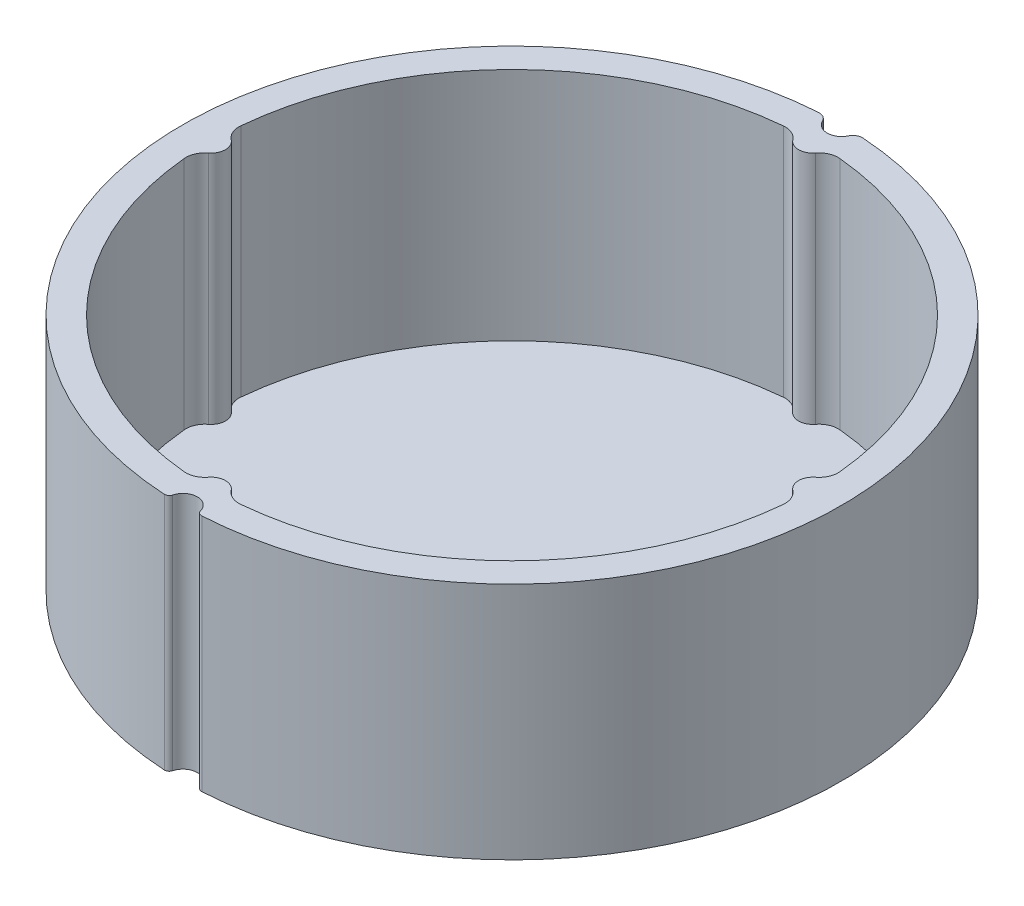
ISO-10303-21;
HEADER;
FILE_DESCRIPTION(('STEP AP214'),'2;1');
FILE_NAME('part.step','',(''),(''),'','','');
FILE_SCHEMA(('AUTOMOTIVE_DESIGN { 1 0 10303 214 1 1 1 1 }'));
ENDSEC;
DATA;
#1=APPLICATION_CONTEXT('core data for automotive mechanical design processes');
#2=APPLICATION_PROTOCOL_DEFINITION('international standard','automotive_design',2000,#1);
#3=PRODUCT_CONTEXT('',#1,'mechanical');
#4=PRODUCT('Part','Part','',(#3));
#5=PRODUCT_RELATED_PRODUCT_CATEGORY('part','',(#4));
#6=PRODUCT_DEFINITION_FORMATION('','',#4);
#7=PRODUCT_DEFINITION_CONTEXT('part definition',#1,'design');
#8=PRODUCT_DEFINITION('design','',#6,#7);
#9=PRODUCT_DEFINITION_SHAPE('','',#8);
#10=(LENGTH_UNIT() NAMED_UNIT(*) SI_UNIT(.MILLI.,.METRE.));
#11=(NAMED_UNIT(*) PLANE_ANGLE_UNIT() SI_UNIT($,.RADIAN.));
#12=(NAMED_UNIT(*) SI_UNIT($,.STERADIAN.) SOLID_ANGLE_UNIT());
#13=UNCERTAINTY_MEASURE_WITH_UNIT(LENGTH_MEASURE(1.E-05),#10,'distance_accuracy_value','');
#14=(GEOMETRIC_REPRESENTATION_CONTEXT(3) GLOBAL_UNCERTAINTY_ASSIGNED_CONTEXT((#13)) GLOBAL_UNIT_ASSIGNED_CONTEXT((#10,
#11,#12)) REPRESENTATION_CONTEXT('',''));
#15=CARTESIAN_POINT('',(0.,0.,0.));
#16=DIRECTION('',(0.,0.,1.));
#17=DIRECTION('',(1.,0.,0.));
#18=AXIS2_PLACEMENT_3D('',#15,#16,#17);
#19=CARTESIAN_POINT('',(0.,25.,0.));
#20=DIRECTION('',(0.,1.,0.));
#21=DIRECTION('',(0.,0.,1.));
#22=AXIS2_PLACEMENT_3D('',#19,#20,#21);
#23=PLANE('',#22);
#24=CARTESIAN_POINT('',(-1.93575856721061,25.,33.9428491683965));
#25=DIRECTION('',(0.,1.,0.));
#26=DIRECTION('',(0.,0.,1.));
#27=AXIS2_PLACEMENT_3D('',#24,#25,#26);
#28=CIRCLE('',#27,0.500000000000003);
#29=CARTESIAN_POINT('',(-1.45181892540796,25.,34.0685568574689));
#30=VERTEX_POINT('',#29);
#31=CARTESIAN_POINT('',(-1.96422560496371,25.,34.4420381383884));
#32=VERTEX_POINT('',#31);
#33=EDGE_CURVE('E338',#30,#32,#28,.F.);
#34=ORIENTED_EDGE('',*,*,#33,.F.);
#35=CARTESIAN_POINT('',(0.,25.,34.4456799246862));
#36=DIRECTION('',(0.,1.,0.));
#37=DIRECTION('',(0.,0.,1.));
#38=AXIS2_PLACEMENT_3D('',#35,#36,#37);
#39=CIRCLE('',#38,1.50000000000002);
#40=CARTESIAN_POINT('',(1.45181892540796,25.,34.0685568574689));
#41=VERTEX_POINT('',#40);
#42=EDGE_CURVE('E342',#41,#30,#39,.T.);
#43=ORIENTED_EDGE('',*,*,#42,.F.);
#44=CARTESIAN_POINT('',(1.93575856721061,25.,33.9428491683965));
#45=DIRECTION('',(0.,1.,0.));
#46=DIRECTION('',(0.,0.,1.));
#47=AXIS2_PLACEMENT_3D('',#44,#45,#46);
#48=CIRCLE('',#47,0.500000000000003);
#49=CARTESIAN_POINT('',(1.9642256049637,25.,34.4420381383884));
#50=VERTEX_POINT('',#49);
#51=EDGE_CURVE('E347',#41,#50,#48,.T.);
#52=ORIENTED_EDGE('',*,*,#51,.T.);
#53=CARTESIAN_POINT('',(0.,25.,-0.0020007910519898));
#54=DIRECTION('',(0.,1.,0.));
#55=DIRECTION('',(0.,0.,1.));
#56=AXIS2_PLACEMENT_3D('',#53,#54,#55);
#57=CIRCLE('',#56,34.5);
#58=CARTESIAN_POINT('',(2.32413582105506,25.,-34.4236276074198));
#59=VERTEX_POINT('',#58);
#60=EDGE_CURVE('E350',#50,#59,#57,.T.);
#61=ORIENTED_EDGE('',*,*,#60,.T.);
#62=CARTESIAN_POINT('',(2.2567695653723,25.,-33.4258992939019));
#63=DIRECTION('',(0.,1.,0.));
#64=DIRECTION('',(0.,0.,1.));
#65=AXIS2_PLACEMENT_3D('',#62,#63,#64);
#66=CIRCLE('',#65,1.);
#67=CARTESIAN_POINT('',(1.35406173922335,25.,-33.8561533823304));
#68=VERTEX_POINT('',#67);
#69=EDGE_CURVE('E353',#68,#59,#66,.F.);
#70=ORIENTED_EDGE('',*,*,#69,.F.);
#71=CARTESIAN_POINT('',(0.,25.,-34.5015345149731));
#72=DIRECTION('',(0.,1.,0.));
#73=DIRECTION('',(0.,0.,1.));
#74=AXIS2_PLACEMENT_3D('',#71,#72,#73);
#75=CIRCLE('',#74,1.49999999999991);
#76=CARTESIAN_POINT('',(-1.35406173922335,25.,-33.8561533823304));
#77=VERTEX_POINT('',#76);
#78=EDGE_CURVE('E357',#77,#68,#75,.T.);
#79=ORIENTED_EDGE('',*,*,#78,.F.);
#80=CARTESIAN_POINT('',(-2.2567695653723,25.,-33.4258992939019));
#81=DIRECTION('',(0.,1.,0.));
#82=DIRECTION('',(0.,0.,1.));
#83=AXIS2_PLACEMENT_3D('',#80,#81,#82);
#84=CIRCLE('',#83,1.);
#85=CARTESIAN_POINT('',(-2.32413582105505,25.,-34.4236276074198));
#86=VERTEX_POINT('',#85);
#87=EDGE_CURVE('E361',#77,#86,#84,.T.);
#88=ORIENTED_EDGE('',*,*,#87,.T.);
#89=CARTESIAN_POINT('',(0.,25.,-0.0020007910519898));
#90=DIRECTION('',(0.,1.,0.));
#91=DIRECTION('',(0.,0.,1.));
#92=AXIS2_PLACEMENT_3D('',#89,#90,#91);
#93=CIRCLE('',#92,34.5);
#94=EDGE_CURVE('E364',#86,#32,#93,.T.);
#95=ORIENTED_EDGE('',*,*,#94,.T.);
#96=EDGE_LOOP('',(#34,#43,#52,#61,#70,#79,#88,#95));
#97=FACE_BOUND('',#96,.T.);
#98=CARTESIAN_POINT('',(0.,25.,0.));
#99=DIRECTION('',(0.,1.,0.));
#100=DIRECTION('',(0.,0.,1.));
#101=AXIS2_PLACEMENT_3D('',#98,#99,#100);
#102=CIRCLE('',#101,31.5);
#103=CARTESIAN_POINT('',(-31.3601694915254,25.,2.96475453668566));
#104=VERTEX_POINT('',#103);
#105=CARTESIAN_POINT('',(-2.96475453668564,25.,31.3601694915254));
#106=VERTEX_POINT('',#105);
#107=EDGE_CURVE('E233',#104,#106,#102,.T.);
#108=ORIENTED_EDGE('',*,*,#107,.F.);
#109=CARTESIAN_POINT('',(-29.3690476190476,25.,2.77651615340405));
#110=DIRECTION('',(0.,1.,0.));
#111=DIRECTION('',(0.,0.,1.));
#112=AXIS2_PLACEMENT_3D('',#109,#110,#111);
#113=CIRCLE('',#112,2.00000000000001);
#114=CARTESIAN_POINT('',(-30.5867346938775,25.,1.18993549431604));
#115=VERTEX_POINT('',#114);
#116=EDGE_CURVE('E229',#115,#104,#113,.T.);
#117=ORIENTED_EDGE('',*,*,#116,.F.);
#118=CARTESIAN_POINT('',(-31.5,25.,0.));
#119=DIRECTION('',(0.,-1.,0.));
#120=DIRECTION('',(0.,0.,1.));
#121=AXIS2_PLACEMENT_3D('',#118,#119,#120);
#122=CIRCLE('',#121,1.50000000000004);
#123=CARTESIAN_POINT('',(-30.5867346938775,25.,-1.18993549431604));
#124=VERTEX_POINT('',#123);
#125=EDGE_CURVE('E211',#124,#115,#122,.T.);
#126=ORIENTED_EDGE('',*,*,#125,.F.);
#127=CARTESIAN_POINT('',(-29.3690476190476,25.,-2.77651615340405));
#128=DIRECTION('',(0.,1.,0.));
#129=DIRECTION('',(0.,0.,-1.));
#130=AXIS2_PLACEMENT_3D('',#127,#128,#129);
#131=CIRCLE('',#130,2.00000000000001);
#132=CARTESIAN_POINT('',(-31.3601694915254,25.,-2.96475453668568));
#133=VERTEX_POINT('',#132);
#134=EDGE_CURVE('E277',#133,#124,#131,.T.);
#135=ORIENTED_EDGE('',*,*,#134,.F.);
#136=CARTESIAN_POINT('',(0.,25.,0.));
#137=DIRECTION('',(0.,1.,0.));
#138=DIRECTION('',(0.,0.,1.));
#139=AXIS2_PLACEMENT_3D('',#136,#137,#138);
#140=CIRCLE('',#139,31.5);
#141=CARTESIAN_POINT('',(-2.96475453668563,25.,-31.3601694915254));
#142=VERTEX_POINT('',#141);
#143=EDGE_CURVE('E274',#142,#133,#140,.T.);
#144=ORIENTED_EDGE('',*,*,#143,.F.);
#145=CARTESIAN_POINT('',(-2.77651615340401,25.,-29.3690476190476));
#146=DIRECTION('',(0.,1.,0.));
#147=DIRECTION('',(0.,0.,1.));
#148=AXIS2_PLACEMENT_3D('',#145,#146,#147);
#149=CIRCLE('',#148,2.);
#150=CARTESIAN_POINT('',(-1.189935494316,25.,-30.5867346938775));
#151=VERTEX_POINT('',#150);
#152=EDGE_CURVE('E271',#151,#142,#149,.T.);
#153=ORIENTED_EDGE('',*,*,#152,.F.);
#154=CARTESIAN_POINT('',(0.,25.,-31.5));
#155=DIRECTION('',(0.,-1.,0.));
#156=DIRECTION('',(0.,0.,1.));
#157=AXIS2_PLACEMENT_3D('',#154,#155,#156);
#158=CIRCLE('',#157,1.5);
#159=CARTESIAN_POINT('',(1.189935494316,25.,-30.5867346938775));
#160=VERTEX_POINT('',#159);
#161=EDGE_CURVE('E268',#160,#151,#158,.T.);
#162=ORIENTED_EDGE('',*,*,#161,.F.);
#163=CARTESIAN_POINT('',(2.77651615340401,25.,-29.3690476190476));
#164=DIRECTION('',(0.,1.,0.));
#165=DIRECTION('',(0.,0.,-1.));
#166=AXIS2_PLACEMENT_3D('',#163,#164,#165);
#167=CIRCLE('',#166,2.);
#168=CARTESIAN_POINT('',(2.96475453668564,25.,-31.3601694915254));
#169=VERTEX_POINT('',#168);
#170=EDGE_CURVE('E265',#169,#160,#167,.T.);
#171=ORIENTED_EDGE('',*,*,#170,.F.);
#172=CARTESIAN_POINT('',(0.,25.,0.));
#173=DIRECTION('',(0.,1.,0.));
#174=DIRECTION('',(0.,0.,1.));
#175=AXIS2_PLACEMENT_3D('',#172,#173,#174);
#176=CIRCLE('',#175,31.5);
#177=CARTESIAN_POINT('',(31.3601694915254,25.,-2.96475453668564));
#178=VERTEX_POINT('',#177);
#179=EDGE_CURVE('E262',#178,#169,#176,.T.);
#180=ORIENTED_EDGE('',*,*,#179,.F.);
#181=CARTESIAN_POINT('',(29.3690476190476,25.,-2.77651615340401));
#182=DIRECTION('',(0.,1.,0.));
#183=DIRECTION('',(0.,0.,1.));
#184=AXIS2_PLACEMENT_3D('',#181,#182,#183);
#185=CIRCLE('',#184,2.);
#186=CARTESIAN_POINT('',(30.5867346938775,25.,-1.189935494316));
#187=VERTEX_POINT('',#186);
#188=EDGE_CURVE('E259',#187,#178,#185,.T.);
#189=ORIENTED_EDGE('',*,*,#188,.F.);
#190=CARTESIAN_POINT('',(31.5,25.,0.));
#191=DIRECTION('',(0.,-1.,0.));
#192=DIRECTION('',(0.,0.,1.));
#193=AXIS2_PLACEMENT_3D('',#190,#191,#192);
#194=CIRCLE('',#193,1.5);
#195=CARTESIAN_POINT('',(30.5867346938775,25.,1.189935494316));
#196=VERTEX_POINT('',#195);
#197=EDGE_CURVE('E256',#196,#187,#194,.T.);
#198=ORIENTED_EDGE('',*,*,#197,.F.);
#199=CARTESIAN_POINT('',(29.3690476190476,25.,2.77651615340401));
#200=DIRECTION('',(0.,1.,0.));
#201=DIRECTION('',(0.,0.,-1.));
#202=AXIS2_PLACEMENT_3D('',#199,#200,#201);
#203=CIRCLE('',#202,2.);
#204=CARTESIAN_POINT('',(31.3601694915254,25.,2.96475453668564));
#205=VERTEX_POINT('',#204);
#206=EDGE_CURVE('E253',#205,#196,#203,.T.);
#207=ORIENTED_EDGE('',*,*,#206,.F.);
#208=CARTESIAN_POINT('',(0.,25.,0.));
#209=DIRECTION('',(0.,1.,0.));
#210=DIRECTION('',(0.,0.,1.));
#211=AXIS2_PLACEMENT_3D('',#208,#209,#210);
#212=CIRCLE('',#211,31.5);
#213=CARTESIAN_POINT('',(2.96475453668564,25.,31.3601694915254));
#214=VERTEX_POINT('',#213);
#215=EDGE_CURVE('E250',#214,#205,#212,.T.);
#216=ORIENTED_EDGE('',*,*,#215,.F.);
#217=CARTESIAN_POINT('',(2.77651615340401,25.,29.3690476190476));
#218=DIRECTION('',(0.,1.,0.));
#219=DIRECTION('',(0.,0.,1.));
#220=AXIS2_PLACEMENT_3D('',#217,#218,#219);
#221=CIRCLE('',#220,2.);
#222=CARTESIAN_POINT('',(1.189935494316,25.,30.5867346938775));
#223=VERTEX_POINT('',#222);
#224=EDGE_CURVE('E247',#223,#214,#221,.T.);
#225=ORIENTED_EDGE('',*,*,#224,.F.);
#226=CARTESIAN_POINT('',(0.,25.,31.5));
#227=DIRECTION('',(0.,-1.,0.));
#228=DIRECTION('',(0.,0.,1.));
#229=AXIS2_PLACEMENT_3D('',#226,#227,#228);
#230=CIRCLE('',#229,1.5);
#231=CARTESIAN_POINT('',(-1.189935494316,25.,30.5867346938775));
#232=VERTEX_POINT('',#231);
#233=EDGE_CURVE('E244',#232,#223,#230,.T.);
#234=ORIENTED_EDGE('',*,*,#233,.F.);
#235=CARTESIAN_POINT('',(-2.77651615340401,25.,29.3690476190476));
#236=DIRECTION('',(0.,1.,0.));
#237=DIRECTION('',(0.,0.,-1.));
#238=AXIS2_PLACEMENT_3D('',#235,#236,#237);
#239=CIRCLE('',#238,2.);
#240=EDGE_CURVE('E241',#106,#232,#239,.T.);
#241=ORIENTED_EDGE('',*,*,#240,.F.);
#242=EDGE_LOOP('',(#108,#117,#126,#135,#144,#153,#162,#171,#180,#189,#198,#207,#216,#225,#234,#241));
#243=FACE_BOUND('',#242,.T.);
#244=ADVANCED_FACE('F41',(#97,#243),#23,.T.);
#245=CARTESIAN_POINT('',(0.,0.,0.));
#246=DIRECTION('',(0.,1.,0.));
#247=DIRECTION('',(0.,0.,1.));
#248=AXIS2_PLACEMENT_3D('',#245,#246,#247);
#249=PLANE('',#248);
#250=CARTESIAN_POINT('',(-1.93575856721061,0.,33.9428491683965));
#251=DIRECTION('',(0.,1.,0.));
#252=DIRECTION('',(0.,0.,1.));
#253=AXIS2_PLACEMENT_3D('',#250,#251,#252);
#254=CIRCLE('',#253,0.500000000000003);
#255=CARTESIAN_POINT('',(-1.45181892540796,0.,34.0685568574689));
#256=VERTEX_POINT('',#255);
#257=CARTESIAN_POINT('',(-1.96422560496371,0.,34.4420381383884));
#258=VERTEX_POINT('',#257);
#259=EDGE_CURVE('E337',#256,#258,#254,.F.);
#260=ORIENTED_EDGE('',*,*,#259,.T.);
#261=CARTESIAN_POINT('',(0.,0.,-0.0020007910519898));
#262=DIRECTION('',(0.,1.,0.));
#263=DIRECTION('',(0.,0.,1.));
#264=AXIS2_PLACEMENT_3D('',#261,#262,#263);
#265=CIRCLE('',#264,34.5);
#266=CARTESIAN_POINT('',(-2.32413582105505,0.,-34.4236276074198));
#267=VERTEX_POINT('',#266);
#268=EDGE_CURVE('E343',#267,#258,#265,.T.);
#269=ORIENTED_EDGE('',*,*,#268,.F.);
#270=CARTESIAN_POINT('',(-2.2567695653723,0.,-33.4258992939019));
#271=DIRECTION('',(0.,1.,0.));
#272=DIRECTION('',(0.,0.,1.));
#273=AXIS2_PLACEMENT_3D('',#270,#271,#272);
#274=CIRCLE('',#273,1.);
#275=CARTESIAN_POINT('',(-1.35406173922335,0.,-33.8561533823304));
#276=VERTEX_POINT('',#275);
#277=EDGE_CURVE('E390',#276,#267,#274,.T.);
#278=ORIENTED_EDGE('',*,*,#277,.F.);
#279=CARTESIAN_POINT('',(0.,0.,-34.5015345149731));
#280=DIRECTION('',(0.,1.,0.));
#281=DIRECTION('',(0.,0.,1.));
#282=AXIS2_PLACEMENT_3D('',#279,#280,#281);
#283=CIRCLE('',#282,1.49999999999991);
#284=CARTESIAN_POINT('',(1.35406173922335,0.,-33.8561533823304));
#285=VERTEX_POINT('',#284);
#286=EDGE_CURVE('E386',#276,#285,#283,.T.);
#287=ORIENTED_EDGE('',*,*,#286,.T.);
#288=CARTESIAN_POINT('',(2.2567695653723,0.,-33.4258992939019));
#289=DIRECTION('',(0.,1.,0.));
#290=DIRECTION('',(0.,0.,1.));
#291=AXIS2_PLACEMENT_3D('',#288,#289,#290);
#292=CIRCLE('',#291,1.);
#293=CARTESIAN_POINT('',(2.32413582105506,0.,-34.4236276074198));
#294=VERTEX_POINT('',#293);
#295=EDGE_CURVE('E382',#285,#294,#292,.F.);
#296=ORIENTED_EDGE('',*,*,#295,.T.);
#297=CARTESIAN_POINT('',(0.,0.,-0.0020007910519898));
#298=DIRECTION('',(0.,1.,0.));
#299=DIRECTION('',(0.,0.,1.));
#300=AXIS2_PLACEMENT_3D('',#297,#298,#299);
#301=CIRCLE('',#300,34.5);
#302=CARTESIAN_POINT('',(1.9642256049637,0.,34.4420381383884));
#303=VERTEX_POINT('',#302);
#304=EDGE_CURVE('E378',#303,#294,#301,.T.);
#305=ORIENTED_EDGE('',*,*,#304,.F.);
#306=CARTESIAN_POINT('',(1.93575856721061,0.,33.9428491683965));
#307=DIRECTION('',(0.,1.,0.));
#308=DIRECTION('',(0.,0.,1.));
#309=AXIS2_PLACEMENT_3D('',#306,#307,#308);
#310=CIRCLE('',#309,0.500000000000003);
#311=CARTESIAN_POINT('',(1.45181892540796,0.,34.0685568574689));
#312=VERTEX_POINT('',#311);
#313=EDGE_CURVE('E375',#312,#303,#310,.T.);
#314=ORIENTED_EDGE('',*,*,#313,.F.);
#315=CARTESIAN_POINT('',(0.,0.,34.4456799246862));
#316=DIRECTION('',(0.,1.,0.));
#317=DIRECTION('',(0.,0.,1.));
#318=AXIS2_PLACEMENT_3D('',#315,#316,#317);
#319=CIRCLE('',#318,1.50000000000002);
#320=EDGE_CURVE('E371',#312,#256,#319,.T.);
#321=ORIENTED_EDGE('',*,*,#320,.T.);
#322=EDGE_LOOP('',(#260,#269,#278,#287,#296,#305,#314,#321));
#323=FACE_BOUND('',#322,.T.);
#324=ADVANCED_FACE('F425',(#323),#249,.F.);
#325=CARTESIAN_POINT('',(-1.93575856721061,25.,33.9428491683965));
#326=DIRECTION('',(0.,-1.,0.));
#327=DIRECTION('',(0.,0.,-1.));
#328=AXIS2_PLACEMENT_3D('',#325,#326,#327);
#329=CYLINDRICAL_SURFACE('',#328,0.500000000000003);
#330=ORIENTED_EDGE('',*,*,#259,.F.);
#331=DIRECTION('',(0.,-1.,0.));
#332=VECTOR('',#331,1.);
#333=CARTESIAN_POINT('',(-1.45181892540796,25.,34.0685568574689));
#334=LINE('',#333,#332);
#335=EDGE_CURVE('E11',#30,#256,#334,.T.);
#336=ORIENTED_EDGE('',*,*,#335,.F.);
#337=ORIENTED_EDGE('',*,*,#33,.T.);
#338=DIRECTION('',(0.,-1.,0.));
#339=VECTOR('',#338,1.);
#340=CARTESIAN_POINT('',(-1.96422560496371,25.,34.4420381383884));
#341=LINE('',#340,#339);
#342=EDGE_CURVE('E367',#32,#258,#341,.T.);
#343=ORIENTED_EDGE('',*,*,#342,.T.);
#344=EDGE_LOOP('',(#330,#336,#337,#343));
#345=FACE_BOUND('',#344,.T.);
#346=ADVANCED_FACE('F43',(#345),#329,.T.);
#347=CARTESIAN_POINT('',(0.,25.,34.4456799246862));
#348=DIRECTION('',(0.,-1.,0.));
#349=DIRECTION('',(0.,0.,-1.));
#350=AXIS2_PLACEMENT_3D('',#347,#348,#349);
#351=CYLINDRICAL_SURFACE('',#350,1.50000000000002);
#352=ORIENTED_EDGE('',*,*,#320,.F.);
#353=DIRECTION('',(0.,-1.,0.));
#354=VECTOR('',#353,1.);
#355=CARTESIAN_POINT('',(1.45181892540796,25.,34.0685568574689));
#356=LINE('',#355,#354);
#357=EDGE_CURVE('E50',#41,#312,#356,.T.);
#358=ORIENTED_EDGE('',*,*,#357,.F.);
#359=ORIENTED_EDGE('',*,*,#42,.T.);
#360=ORIENTED_EDGE('',*,*,#335,.T.);
#361=EDGE_LOOP('',(#352,#358,#359,#360));
#362=FACE_BOUND('',#361,.T.);
#363=ADVANCED_FACE('F426',(#362),#351,.F.);
#364=CARTESIAN_POINT('',(1.93575856721061,25.,33.9428491683965));
#365=DIRECTION('',(0.,-1.,0.));
#366=DIRECTION('',(0.,0.,-1.));
#367=AXIS2_PLACEMENT_3D('',#364,#365,#366);
#368=CYLINDRICAL_SURFACE('',#367,0.500000000000003);
#369=ORIENTED_EDGE('',*,*,#313,.T.);
#370=DIRECTION('',(0.,-1.,0.));
#371=VECTOR('',#370,1.);
#372=CARTESIAN_POINT('',(1.9642256049637,25.,34.4420381383884));
#373=LINE('',#372,#371);
#374=EDGE_CURVE('E411',#50,#303,#373,.T.);
#375=ORIENTED_EDGE('',*,*,#374,.F.);
#376=ORIENTED_EDGE('',*,*,#51,.F.);
#377=ORIENTED_EDGE('',*,*,#357,.T.);
#378=EDGE_LOOP('',(#369,#375,#376,#377));
#379=FACE_BOUND('',#378,.T.);
#380=ADVANCED_FACE('F418',(#379),#368,.T.);
#381=CARTESIAN_POINT('',(0.,25.,-0.0020007910519898));
#382=DIRECTION('',(0.,-1.,0.));
#383=DIRECTION('',(0.,0.,-1.));
#384=AXIS2_PLACEMENT_3D('',#381,#382,#383);
#385=CYLINDRICAL_SURFACE('',#384,34.5);
#386=ORIENTED_EDGE('',*,*,#304,.T.);
#387=DIRECTION('',(0.,-1.,0.));
#388=VECTOR('',#387,1.);
#389=CARTESIAN_POINT('',(2.32413582105506,25.,-34.4236276074198));
#390=LINE('',#389,#388);
#391=EDGE_CURVE('E408',#59,#294,#390,.T.);
#392=ORIENTED_EDGE('',*,*,#391,.F.);
#393=ORIENTED_EDGE('',*,*,#60,.F.);
#394=ORIENTED_EDGE('',*,*,#374,.T.);
#395=EDGE_LOOP('',(#386,#392,#393,#394));
#396=FACE_BOUND('',#395,.T.);
#397=ADVANCED_FACE('F451',(#396),#385,.T.);
#398=CARTESIAN_POINT('',(2.2567695653723,25.,-33.4258992939019));
#399=DIRECTION('',(0.,-1.,0.));
#400=DIRECTION('',(0.,0.,-1.));
#401=AXIS2_PLACEMENT_3D('',#398,#399,#400);
#402=CYLINDRICAL_SURFACE('',#401,1.);
#403=ORIENTED_EDGE('',*,*,#295,.F.);
#404=DIRECTION('',(0.,-1.,0.));
#405=VECTOR('',#404,1.);
#406=CARTESIAN_POINT('',(1.35406173922335,25.,-33.8561533823304));
#407=LINE('',#406,#405);
#408=EDGE_CURVE('E405',#68,#285,#407,.T.);
#409=ORIENTED_EDGE('',*,*,#408,.F.);
#410=ORIENTED_EDGE('',*,*,#69,.T.);
#411=ORIENTED_EDGE('',*,*,#391,.T.);
#412=EDGE_LOOP('',(#403,#409,#410,#411));
#413=FACE_BOUND('',#412,.T.);
#414=ADVANCED_FACE('F446',(#413),#402,.T.);
#415=CARTESIAN_POINT('',(0.,25.,-34.5015345149731));
#416=DIRECTION('',(0.,-1.,0.));
#417=DIRECTION('',(0.,0.,-1.));
#418=AXIS2_PLACEMENT_3D('',#415,#416,#417);
#419=CYLINDRICAL_SURFACE('',#418,1.49999999999991);
#420=ORIENTED_EDGE('',*,*,#286,.F.);
#421=DIRECTION('',(0.,-1.,0.));
#422=VECTOR('',#421,1.);
#423=CARTESIAN_POINT('',(-1.35406173922335,25.,-33.8561533823304));
#424=LINE('',#423,#422);
#425=EDGE_CURVE('E402',#77,#276,#424,.T.);
#426=ORIENTED_EDGE('',*,*,#425,.F.);
#427=ORIENTED_EDGE('',*,*,#78,.T.);
#428=ORIENTED_EDGE('',*,*,#408,.T.);
#429=EDGE_LOOP('',(#420,#426,#427,#428));
#430=FACE_BOUND('',#429,.T.);
#431=ADVANCED_FACE('F443',(#430),#419,.F.);
#432=CARTESIAN_POINT('',(-2.2567695653723,25.,-33.4258992939019));
#433=DIRECTION('',(0.,-1.,0.));
#434=DIRECTION('',(0.,0.,-1.));
#435=AXIS2_PLACEMENT_3D('',#432,#433,#434);
#436=CYLINDRICAL_SURFACE('',#435,1.);
#437=ORIENTED_EDGE('',*,*,#277,.T.);
#438=DIRECTION('',(0.,-1.,0.));
#439=VECTOR('',#438,1.);
#440=CARTESIAN_POINT('',(-2.32413582105505,25.,-34.4236276074198));
#441=LINE('',#440,#439);
#442=EDGE_CURVE('E398',#86,#267,#441,.T.);
#443=ORIENTED_EDGE('',*,*,#442,.F.);
#444=ORIENTED_EDGE('',*,*,#87,.F.);
#445=ORIENTED_EDGE('',*,*,#425,.T.);
#446=EDGE_LOOP('',(#437,#443,#444,#445));
#447=FACE_BOUND('',#446,.T.);
#448=ADVANCED_FACE('F440',(#447),#436,.T.);
#449=CARTESIAN_POINT('',(0.,25.,-0.0020007910519898));
#450=DIRECTION('',(0.,-1.,0.));
#451=DIRECTION('',(0.,0.,-1.));
#452=AXIS2_PLACEMENT_3D('',#449,#450,#451);
#453=CYLINDRICAL_SURFACE('',#452,34.5);
#454=ORIENTED_EDGE('',*,*,#268,.T.);
#455=ORIENTED_EDGE('',*,*,#342,.F.);
#456=ORIENTED_EDGE('',*,*,#94,.F.);
#457=ORIENTED_EDGE('',*,*,#442,.T.);
#458=EDGE_LOOP('',(#454,#455,#456,#457));
#459=FACE_BOUND('',#458,.T.);
#460=ADVANCED_FACE('F435',(#459),#453,.T.);
#461=CARTESIAN_POINT('',(-29.3690476190476,25.,2.77651615340405));
#462=DIRECTION('',(0.,-1.,0.));
#463=DIRECTION('',(0.,0.,-1.));
#464=AXIS2_PLACEMENT_3D('',#461,#462,#463);
#465=CYLINDRICAL_SURFACE('',#464,2.00000000000001);
#466=CARTESIAN_POINT('',(-29.3690476190476,0.4,2.77651615340405));
#467=DIRECTION('',(0.,1.,0.));
#468=DIRECTION('',(0.,0.,1.));
#469=AXIS2_PLACEMENT_3D('',#466,#467,#468);
#470=CIRCLE('',#469,2.00000000000001);
#471=CARTESIAN_POINT('',(-30.5867346938775,0.4,1.18993549431604));
#472=VERTEX_POINT('',#471);
#473=CARTESIAN_POINT('',(-31.3601694915254,0.400000000000001,2.96475453668566));
#474=VERTEX_POINT('',#473);
#475=EDGE_CURVE('E218',#472,#474,#470,.T.);
#476=ORIENTED_EDGE('',*,*,#475,.F.);
#477=DIRECTION('',(0.,-1.,0.));
#478=VECTOR('',#477,1.);
#479=CARTESIAN_POINT('',(-30.5867346938775,25.,1.18993549431604));
#480=LINE('',#479,#478);
#481=EDGE_CURVE('E204',#115,#472,#480,.T.);
#482=ORIENTED_EDGE('',*,*,#481,.F.);
#483=ORIENTED_EDGE('',*,*,#116,.T.);
#484=DIRECTION('',(0.,-1.,0.));
#485=VECTOR('',#484,1.);
#486=CARTESIAN_POINT('',(-31.3601694915254,25.,2.96475453668566));
#487=LINE('',#486,#485);
#488=EDGE_CURVE('E220',#104,#474,#487,.T.);
#489=ORIENTED_EDGE('',*,*,#488,.T.);
#490=EDGE_LOOP('',(#476,#482,#483,#489));
#491=FACE_BOUND('',#490,.T.);
#492=ADVANCED_FACE('F219',(#491),#465,.F.);
#493=CARTESIAN_POINT('',(0.,25.,0.));
#494=DIRECTION('',(0.,-1.,0.));
#495=DIRECTION('',(0.,0.,-1.));
#496=AXIS2_PLACEMENT_3D('',#493,#494,#495);
#497=CYLINDRICAL_SURFACE('',#496,31.5);
#498=CARTESIAN_POINT('',(0.,0.4,0.));
#499=DIRECTION('',(0.,1.,0.));
#500=DIRECTION('',(0.,0.,1.));
#501=AXIS2_PLACEMENT_3D('',#498,#499,#500);
#502=CIRCLE('',#501,31.5);
#503=CARTESIAN_POINT('',(-2.96475453668564,0.400000000000001,31.3601694915254));
#504=VERTEX_POINT('',#503);
#505=EDGE_CURVE('E57',#474,#504,#502,.T.);
#506=ORIENTED_EDGE('',*,*,#505,.F.);
#507=ORIENTED_EDGE('',*,*,#488,.F.);
#508=ORIENTED_EDGE('',*,*,#107,.T.);
#509=DIRECTION('',(0.,-1.,0.));
#510=VECTOR('',#509,1.);
#511=CARTESIAN_POINT('',(-2.96475453668564,25.,31.3601694915254));
#512=LINE('',#511,#510);
#513=EDGE_CURVE('E332',#106,#504,#512,.T.);
#514=ORIENTED_EDGE('',*,*,#513,.T.);
#515=EDGE_LOOP('',(#506,#507,#508,#514));
#516=FACE_BOUND('',#515,.T.);
#517=ADVANCED_FACE('F459',(#516),#497,.F.);
#518=CARTESIAN_POINT('',(-2.77651615340401,25.,29.3690476190476));
#519=DIRECTION('',(0.,-1.,0.));
#520=DIRECTION('',(0.,0.,-1.));
#521=AXIS2_PLACEMENT_3D('',#518,#519,#520);
#522=CYLINDRICAL_SURFACE('',#521,2.);
#523=CARTESIAN_POINT('',(-2.77651615340401,0.4,29.3690476190476));
#524=DIRECTION('',(0.,1.,0.));
#525=DIRECTION('',(0.,0.,-1.));
#526=AXIS2_PLACEMENT_3D('',#523,#524,#525);
#527=CIRCLE('',#526,2.);
#528=CARTESIAN_POINT('',(-1.189935494316,0.400000000000001,30.5867346938775));
#529=VERTEX_POINT('',#528);
#530=EDGE_CURVE('E65',#504,#529,#527,.T.);
#531=ORIENTED_EDGE('',*,*,#530,.F.);
#532=ORIENTED_EDGE('',*,*,#513,.F.);
#533=ORIENTED_EDGE('',*,*,#240,.T.);
#534=DIRECTION('',(0.,-1.,0.));
#535=VECTOR('',#534,1.);
#536=CARTESIAN_POINT('',(-1.189935494316,25.,30.5867346938775));
#537=LINE('',#536,#535);
#538=EDGE_CURVE('E329',#232,#529,#537,.T.);
#539=ORIENTED_EDGE('',*,*,#538,.T.);
#540=EDGE_LOOP('',(#531,#532,#533,#539));
#541=FACE_BOUND('',#540,.T.);
#542=ADVANCED_FACE('F460',(#541),#522,.F.);
#543=CARTESIAN_POINT('',(0.,25.,31.5));
#544=DIRECTION('',(0.,-1.,0.));
#545=DIRECTION('',(0.,0.,-1.));
#546=AXIS2_PLACEMENT_3D('',#543,#544,#545);
#547=CYLINDRICAL_SURFACE('',#546,1.5);
#548=CARTESIAN_POINT('',(0.,0.4,31.5));
#549=DIRECTION('',(0.,-1.,0.));
#550=DIRECTION('',(0.,0.,1.));
#551=AXIS2_PLACEMENT_3D('',#548,#549,#550);
#552=CIRCLE('',#551,1.5);
#553=CARTESIAN_POINT('',(1.189935494316,0.400000000000001,30.5867346938775));
#554=VERTEX_POINT('',#553);
#555=EDGE_CURVE('E466',#529,#554,#552,.T.);
#556=ORIENTED_EDGE('',*,*,#555,.F.);
#557=ORIENTED_EDGE('',*,*,#538,.F.);
#558=ORIENTED_EDGE('',*,*,#233,.T.);
#559=DIRECTION('',(0.,-1.,0.));
#560=VECTOR('',#559,1.);
#561=CARTESIAN_POINT('',(1.189935494316,25.,30.5867346938775));
#562=LINE('',#561,#560);
#563=EDGE_CURVE('E325',#223,#554,#562,.T.);
#564=ORIENTED_EDGE('',*,*,#563,.T.);
#565=EDGE_LOOP('',(#556,#557,#558,#564));
#566=FACE_BOUND('',#565,.T.);
#567=ADVANCED_FACE('F463',(#566),#547,.T.);
#568=CARTESIAN_POINT('',(2.77651615340401,25.,29.3690476190476));
#569=DIRECTION('',(0.,-1.,0.));
#570=DIRECTION('',(0.,0.,-1.));
#571=AXIS2_PLACEMENT_3D('',#568,#569,#570);
#572=CYLINDRICAL_SURFACE('',#571,2.);
#573=CARTESIAN_POINT('',(2.77651615340401,0.4,29.3690476190476));
#574=DIRECTION('',(0.,1.,0.));
#575=DIRECTION('',(0.,0.,1.));
#576=AXIS2_PLACEMENT_3D('',#573,#574,#575);
#577=CIRCLE('',#576,2.);
#578=CARTESIAN_POINT('',(2.96475453668564,0.400000000000001,31.3601694915254));
#579=VERTEX_POINT('',#578);
#580=EDGE_CURVE('E482',#554,#579,#577,.T.);
#581=ORIENTED_EDGE('',*,*,#580,.F.);
#582=ORIENTED_EDGE('',*,*,#563,.F.);
#583=ORIENTED_EDGE('',*,*,#224,.T.);
#584=DIRECTION('',(0.,-1.,0.));
#585=VECTOR('',#584,1.);
#586=CARTESIAN_POINT('',(2.96475453668564,25.,31.3601694915254));
#587=LINE('',#586,#585);
#588=EDGE_CURVE('E321',#214,#579,#587,.T.);
#589=ORIENTED_EDGE('',*,*,#588,.T.);
#590=EDGE_LOOP('',(#581,#582,#583,#589));
#591=FACE_BOUND('',#590,.T.);
#592=ADVANCED_FACE('F472',(#591),#572,.F.);
#593=CARTESIAN_POINT('',(0.,25.,0.));
#594=DIRECTION('',(0.,-1.,0.));
#595=DIRECTION('',(0.,0.,-1.));
#596=AXIS2_PLACEMENT_3D('',#593,#594,#595);
#597=CYLINDRICAL_SURFACE('',#596,31.5);
#598=CARTESIAN_POINT('',(0.,0.4,0.));
#599=DIRECTION('',(0.,1.,0.));
#600=DIRECTION('',(0.,0.,1.));
#601=AXIS2_PLACEMENT_3D('',#598,#599,#600);
#602=CIRCLE('',#601,31.5);
#603=CARTESIAN_POINT('',(31.3601694915254,0.400000000000001,2.96475453668564));
#604=VERTEX_POINT('',#603);
#605=EDGE_CURVE('E478',#579,#604,#602,.T.);
#606=ORIENTED_EDGE('',*,*,#605,.F.);
#607=ORIENTED_EDGE('',*,*,#588,.F.);
#608=ORIENTED_EDGE('',*,*,#215,.T.);
#609=DIRECTION('',(0.,-1.,0.));
#610=VECTOR('',#609,1.);
#611=CARTESIAN_POINT('',(31.3601694915254,25.,2.96475453668564));
#612=LINE('',#611,#610);
#613=EDGE_CURVE('E317',#205,#604,#612,.T.);
#614=ORIENTED_EDGE('',*,*,#613,.T.);
#615=EDGE_LOOP('',(#606,#607,#608,#614));
#616=FACE_BOUND('',#615,.T.);
#617=ADVANCED_FACE('F475',(#616),#597,.F.);
#618=CARTESIAN_POINT('',(29.3690476190476,25.,2.77651615340401));
#619=DIRECTION('',(0.,-1.,0.));
#620=DIRECTION('',(0.,0.,-1.));
#621=AXIS2_PLACEMENT_3D('',#618,#619,#620);
#622=CYLINDRICAL_SURFACE('',#621,2.);
#623=CARTESIAN_POINT('',(29.3690476190476,0.4,2.77651615340401));
#624=DIRECTION('',(0.,1.,0.));
#625=DIRECTION('',(0.,0.,-1.));
#626=AXIS2_PLACEMENT_3D('',#623,#624,#625);
#627=CIRCLE('',#626,2.);
#628=CARTESIAN_POINT('',(30.5867346938775,0.400000000000001,1.189935494316));
#629=VERTEX_POINT('',#628);
#630=EDGE_CURVE('E481',#604,#629,#627,.T.);
#631=ORIENTED_EDGE('',*,*,#630,.F.);
#632=ORIENTED_EDGE('',*,*,#613,.F.);
#633=ORIENTED_EDGE('',*,*,#206,.T.);
#634=DIRECTION('',(0.,-1.,0.));
#635=VECTOR('',#634,1.);
#636=CARTESIAN_POINT('',(30.5867346938775,25.,1.189935494316));
#637=LINE('',#636,#635);
#638=EDGE_CURVE('E313',#196,#629,#637,.T.);
#639=ORIENTED_EDGE('',*,*,#638,.T.);
#640=EDGE_LOOP('',(#631,#632,#633,#639));
#641=FACE_BOUND('',#640,.T.);
#642=ADVANCED_FACE('F559',(#641),#622,.F.);
#643=CARTESIAN_POINT('',(31.5,25.,0.));
#644=DIRECTION('',(0.,-1.,0.));
#645=DIRECTION('',(0.,0.,-1.));
#646=AXIS2_PLACEMENT_3D('',#643,#644,#645);
#647=CYLINDRICAL_SURFACE('',#646,1.5);
#648=CARTESIAN_POINT('',(31.5,0.4,0.));
#649=DIRECTION('',(0.,-1.,0.));
#650=DIRECTION('',(0.,0.,1.));
#651=AXIS2_PLACEMENT_3D('',#648,#649,#650);
#652=CIRCLE('',#651,1.5);
#653=CARTESIAN_POINT('',(30.5867346938775,0.400000000000001,-1.189935494316));
#654=VERTEX_POINT('',#653);
#655=EDGE_CURVE('E486',#629,#654,#652,.T.);
#656=ORIENTED_EDGE('',*,*,#655,.F.);
#657=ORIENTED_EDGE('',*,*,#638,.F.);
#658=ORIENTED_EDGE('',*,*,#197,.T.);
#659=DIRECTION('',(0.,-1.,0.));
#660=VECTOR('',#659,1.);
#661=CARTESIAN_POINT('',(30.5867346938775,25.,-1.189935494316));
#662=LINE('',#661,#660);
#663=EDGE_CURVE('E309',#187,#654,#662,.T.);
#664=ORIENTED_EDGE('',*,*,#663,.T.);
#665=EDGE_LOOP('',(#656,#657,#658,#664));
#666=FACE_BOUND('',#665,.T.);
#667=ADVANCED_FACE('F555',(#666),#647,.T.);
#668=CARTESIAN_POINT('',(29.3690476190476,25.,-2.77651615340401));
#669=DIRECTION('',(0.,-1.,0.));
#670=DIRECTION('',(0.,0.,-1.));
#671=AXIS2_PLACEMENT_3D('',#668,#669,#670);
#672=CYLINDRICAL_SURFACE('',#671,2.);
#673=CARTESIAN_POINT('',(29.3690476190476,0.4,-2.77651615340401));
#674=DIRECTION('',(0.,1.,0.));
#675=DIRECTION('',(0.,0.,1.));
#676=AXIS2_PLACEMENT_3D('',#673,#674,#675);
#677=CIRCLE('',#676,2.);
#678=CARTESIAN_POINT('',(31.3601694915254,0.400000000000001,-2.96475453668564));
#679=VERTEX_POINT('',#678);
#680=EDGE_CURVE('E494',#654,#679,#677,.T.);
#681=ORIENTED_EDGE('',*,*,#680,.F.);
#682=ORIENTED_EDGE('',*,*,#663,.F.);
#683=ORIENTED_EDGE('',*,*,#188,.T.);
#684=DIRECTION('',(0.,-1.,0.));
#685=VECTOR('',#684,1.);
#686=CARTESIAN_POINT('',(31.3601694915254,25.,-2.96475453668564));
#687=LINE('',#686,#685);
#688=EDGE_CURVE('E305',#178,#679,#687,.T.);
#689=ORIENTED_EDGE('',*,*,#688,.T.);
#690=EDGE_LOOP('',(#681,#682,#683,#689));
#691=FACE_BOUND('',#690,.T.);
#692=ADVANCED_FACE('F551',(#691),#672,.F.);
#693=CARTESIAN_POINT('',(0.,25.,0.));
#694=DIRECTION('',(0.,-1.,0.));
#695=DIRECTION('',(0.,0.,-1.));
#696=AXIS2_PLACEMENT_3D('',#693,#694,#695);
#697=CYLINDRICAL_SURFACE('',#696,31.5);
#698=CARTESIAN_POINT('',(0.,0.4,0.));
#699=DIRECTION('',(0.,1.,0.));
#700=DIRECTION('',(0.,0.,1.));
#701=AXIS2_PLACEMENT_3D('',#698,#699,#700);
#702=CIRCLE('',#701,31.5);
#703=CARTESIAN_POINT('',(2.96475453668564,0.400000000000001,-31.3601694915254));
#704=VERTEX_POINT('',#703);
#705=EDGE_CURVE('E498',#679,#704,#702,.T.);
#706=ORIENTED_EDGE('',*,*,#705,.F.);
#707=ORIENTED_EDGE('',*,*,#688,.F.);
#708=ORIENTED_EDGE('',*,*,#179,.T.);
#709=DIRECTION('',(0.,-1.,0.));
#710=VECTOR('',#709,1.);
#711=CARTESIAN_POINT('',(2.96475453668564,25.,-31.3601694915254));
#712=LINE('',#711,#710);
#713=EDGE_CURVE('E301',#169,#704,#712,.T.);
#714=ORIENTED_EDGE('',*,*,#713,.T.);
#715=EDGE_LOOP('',(#706,#707,#708,#714));
#716=FACE_BOUND('',#715,.T.);
#717=ADVANCED_FACE('F547',(#716),#697,.F.);
#718=CARTESIAN_POINT('',(2.77651615340401,25.,-29.3690476190476));
#719=DIRECTION('',(0.,-1.,0.));
#720=DIRECTION('',(0.,0.,-1.));
#721=AXIS2_PLACEMENT_3D('',#718,#719,#720);
#722=CYLINDRICAL_SURFACE('',#721,2.);
#723=CARTESIAN_POINT('',(2.77651615340401,0.4,-29.3690476190476));
#724=DIRECTION('',(0.,1.,0.));
#725=DIRECTION('',(0.,0.,-1.));
#726=AXIS2_PLACEMENT_3D('',#723,#724,#725);
#727=CIRCLE('',#726,2.);
#728=CARTESIAN_POINT('',(1.189935494316,0.400000000000001,-30.5867346938775));
#729=VERTEX_POINT('',#728);
#730=EDGE_CURVE('E502',#704,#729,#727,.T.);
#731=ORIENTED_EDGE('',*,*,#730,.F.);
#732=ORIENTED_EDGE('',*,*,#713,.F.);
#733=ORIENTED_EDGE('',*,*,#170,.T.);
#734=DIRECTION('',(0.,-1.,0.));
#735=VECTOR('',#734,1.);
#736=CARTESIAN_POINT('',(1.189935494316,25.,-30.5867346938775));
#737=LINE('',#736,#735);
#738=EDGE_CURVE('E297',#160,#729,#737,.T.);
#739=ORIENTED_EDGE('',*,*,#738,.T.);
#740=EDGE_LOOP('',(#731,#732,#733,#739));
#741=FACE_BOUND('',#740,.T.);
#742=ADVANCED_FACE('F543',(#741),#722,.F.);
#743=CARTESIAN_POINT('',(0.,25.,-31.5));
#744=DIRECTION('',(0.,-1.,0.));
#745=DIRECTION('',(0.,0.,-1.));
#746=AXIS2_PLACEMENT_3D('',#743,#744,#745);
#747=CYLINDRICAL_SURFACE('',#746,1.5);
#748=CARTESIAN_POINT('',(0.,0.4,-31.5));
#749=DIRECTION('',(0.,-1.,0.));
#750=DIRECTION('',(0.,0.,1.));
#751=AXIS2_PLACEMENT_3D('',#748,#749,#750);
#752=CIRCLE('',#751,1.5);
#753=CARTESIAN_POINT('',(-1.189935494316,0.400000000000001,-30.5867346938775));
#754=VERTEX_POINT('',#753);
#755=EDGE_CURVE('E506',#729,#754,#752,.T.);
#756=ORIENTED_EDGE('',*,*,#755,.F.);
#757=ORIENTED_EDGE('',*,*,#738,.F.);
#758=ORIENTED_EDGE('',*,*,#161,.T.);
#759=DIRECTION('',(0.,-1.,0.));
#760=VECTOR('',#759,1.);
#761=CARTESIAN_POINT('',(-1.189935494316,25.,-30.5867346938775));
#762=LINE('',#761,#760);
#763=EDGE_CURVE('E293',#151,#754,#762,.T.);
#764=ORIENTED_EDGE('',*,*,#763,.T.);
#765=EDGE_LOOP('',(#756,#757,#758,#764));
#766=FACE_BOUND('',#765,.T.);
#767=ADVANCED_FACE('F540',(#766),#747,.T.);
#768=CARTESIAN_POINT('',(-2.77651615340401,25.,-29.3690476190476));
#769=DIRECTION('',(0.,-1.,0.));
#770=DIRECTION('',(0.,0.,-1.));
#771=AXIS2_PLACEMENT_3D('',#768,#769,#770);
#772=CYLINDRICAL_SURFACE('',#771,2.);
#773=CARTESIAN_POINT('',(-2.77651615340401,0.4,-29.3690476190476));
#774=DIRECTION('',(0.,1.,0.));
#775=DIRECTION('',(0.,0.,1.));
#776=AXIS2_PLACEMENT_3D('',#773,#774,#775);
#777=CIRCLE('',#776,2.);
#778=CARTESIAN_POINT('',(-2.96475453668563,0.400000000000001,-31.3601694915254));
#779=VERTEX_POINT('',#778);
#780=EDGE_CURVE('E510',#754,#779,#777,.T.);
#781=ORIENTED_EDGE('',*,*,#780,.F.);
#782=ORIENTED_EDGE('',*,*,#763,.F.);
#783=ORIENTED_EDGE('',*,*,#152,.T.);
#784=DIRECTION('',(0.,-1.,0.));
#785=VECTOR('',#784,1.);
#786=CARTESIAN_POINT('',(-2.96475453668563,25.,-31.3601694915254));
#787=LINE('',#786,#785);
#788=EDGE_CURVE('E289',#142,#779,#787,.T.);
#789=ORIENTED_EDGE('',*,*,#788,.T.);
#790=EDGE_LOOP('',(#781,#782,#783,#789));
#791=FACE_BOUND('',#790,.T.);
#792=ADVANCED_FACE('F520',(#791),#772,.F.);
#793=CARTESIAN_POINT('',(0.,25.,0.));
#794=DIRECTION('',(0.,-1.,0.));
#795=DIRECTION('',(0.,0.,-1.));
#796=AXIS2_PLACEMENT_3D('',#793,#794,#795);
#797=CYLINDRICAL_SURFACE('',#796,31.5);
#798=CARTESIAN_POINT('',(0.,0.4,0.));
#799=DIRECTION('',(0.,1.,0.));
#800=DIRECTION('',(0.,0.,1.));
#801=AXIS2_PLACEMENT_3D('',#798,#799,#800);
#802=CIRCLE('',#801,31.5);
#803=CARTESIAN_POINT('',(-31.3601694915254,0.400000000000001,-2.96475453668568));
#804=VERTEX_POINT('',#803);
#805=EDGE_CURVE('E235',#779,#804,#802,.T.);
#806=ORIENTED_EDGE('',*,*,#805,.F.);
#807=ORIENTED_EDGE('',*,*,#788,.F.);
#808=ORIENTED_EDGE('',*,*,#143,.T.);
#809=DIRECTION('',(0.,-1.,0.));
#810=VECTOR('',#809,1.);
#811=CARTESIAN_POINT('',(-31.3601694915254,25.,-2.96475453668568));
#812=LINE('',#811,#810);
#813=EDGE_CURVE('E285',#133,#804,#812,.T.);
#814=ORIENTED_EDGE('',*,*,#813,.T.);
#815=EDGE_LOOP('',(#806,#807,#808,#814));
#816=FACE_BOUND('',#815,.T.);
#817=ADVANCED_FACE('F516',(#816),#797,.F.);
#818=CARTESIAN_POINT('',(-29.3690476190476,25.,-2.77651615340405));
#819=DIRECTION('',(0.,-1.,0.));
#820=DIRECTION('',(0.,0.,-1.));
#821=AXIS2_PLACEMENT_3D('',#818,#819,#820);
#822=CYLINDRICAL_SURFACE('',#821,2.00000000000001);
#823=CARTESIAN_POINT('',(-29.3690476190476,0.4,-2.77651615340405));
#824=DIRECTION('',(0.,1.,0.));
#825=DIRECTION('',(0.,0.,-1.));
#826=AXIS2_PLACEMENT_3D('',#823,#824,#825);
#827=CIRCLE('',#826,2.00000000000001);
#828=CARTESIAN_POINT('',(-30.5867346938775,0.400000000000001,-1.18993549431604));
#829=VERTEX_POINT('',#828);
#830=EDGE_CURVE('E227',#804,#829,#827,.T.);
#831=ORIENTED_EDGE('',*,*,#830,.F.);
#832=ORIENTED_EDGE('',*,*,#813,.F.);
#833=ORIENTED_EDGE('',*,*,#134,.T.);
#834=DIRECTION('',(0.,-1.,0.));
#835=VECTOR('',#834,1.);
#836=CARTESIAN_POINT('',(-30.5867346938775,25.,-1.18993549431604));
#837=LINE('',#836,#835);
#838=EDGE_CURVE('E215',#124,#829,#837,.T.);
#839=ORIENTED_EDGE('',*,*,#838,.T.);
#840=EDGE_LOOP('',(#831,#832,#833,#839));
#841=FACE_BOUND('',#840,.T.);
#842=ADVANCED_FACE('F527',(#841),#822,.F.);
#843=CARTESIAN_POINT('',(-31.5,25.,0.));
#844=DIRECTION('',(0.,-1.,0.));
#845=DIRECTION('',(0.,0.,-1.));
#846=AXIS2_PLACEMENT_3D('',#843,#844,#845);
#847=CYLINDRICAL_SURFACE('',#846,1.50000000000004);
#848=CARTESIAN_POINT('',(-31.5,0.4,0.));
#849=DIRECTION('',(0.,-1.,0.));
#850=DIRECTION('',(0.,0.,1.));
#851=AXIS2_PLACEMENT_3D('',#848,#849,#850);
#852=CIRCLE('',#851,1.50000000000004);
#853=EDGE_CURVE('E208',#829,#472,#852,.T.);
#854=ORIENTED_EDGE('',*,*,#853,.F.);
#855=ORIENTED_EDGE('',*,*,#838,.F.);
#856=ORIENTED_EDGE('',*,*,#125,.T.);
#857=ORIENTED_EDGE('',*,*,#481,.T.);
#858=EDGE_LOOP('',(#854,#855,#856,#857));
#859=FACE_BOUND('',#858,.T.);
#860=ADVANCED_FACE('F206',(#859),#847,.T.);
#861=CARTESIAN_POINT('',(-14.6845238095238,0.4,1.38825807670202));
#862=DIRECTION('',(0.,1.,0.));
#863=DIRECTION('',(0.,0.,1.));
#864=AXIS2_PLACEMENT_3D('',#861,#862,#863);
#865=PLANE('',#864);
#866=ORIENTED_EDGE('',*,*,#475,.T.);
#867=ORIENTED_EDGE('',*,*,#505,.T.);
#868=ORIENTED_EDGE('',*,*,#530,.T.);
#869=ORIENTED_EDGE('',*,*,#555,.T.);
#870=ORIENTED_EDGE('',*,*,#580,.T.);
#871=ORIENTED_EDGE('',*,*,#605,.T.);
#872=ORIENTED_EDGE('',*,*,#630,.T.);
#873=ORIENTED_EDGE('',*,*,#655,.T.);
#874=ORIENTED_EDGE('',*,*,#680,.T.);
#875=ORIENTED_EDGE('',*,*,#705,.T.);
#876=ORIENTED_EDGE('',*,*,#730,.T.);
#877=ORIENTED_EDGE('',*,*,#755,.T.);
#878=ORIENTED_EDGE('',*,*,#780,.T.);
#879=ORIENTED_EDGE('',*,*,#805,.T.);
#880=ORIENTED_EDGE('',*,*,#830,.T.);
#881=ORIENTED_EDGE('',*,*,#853,.T.);
#882=EDGE_LOOP('',(#866,#867,#868,#869,#870,#871,#872,#873,#874,#875,#876,#877,#878,#879,#880,#881));
#883=FACE_BOUND('',#882,.T.);
#884=ADVANCED_FACE('F225',(#883),#865,.T.);
#885=CLOSED_SHELL('',(#244,#324,#346,#363,#380,#397,#414,#431,#448,#460,#492,#517,#542,#567,
#592,#617,#642,#667,#692,#717,#742,#767,#792,#817,#842,#860,#884));
#886=MANIFOLD_SOLID_BREP('B2',#885);
#887=ADVANCED_BREP_SHAPE_REPRESENTATION('',(#18,#886),#14);
#888=SHAPE_DEFINITION_REPRESENTATION(#9,#887);
ENDSEC;
END-ISO-10303-21;
